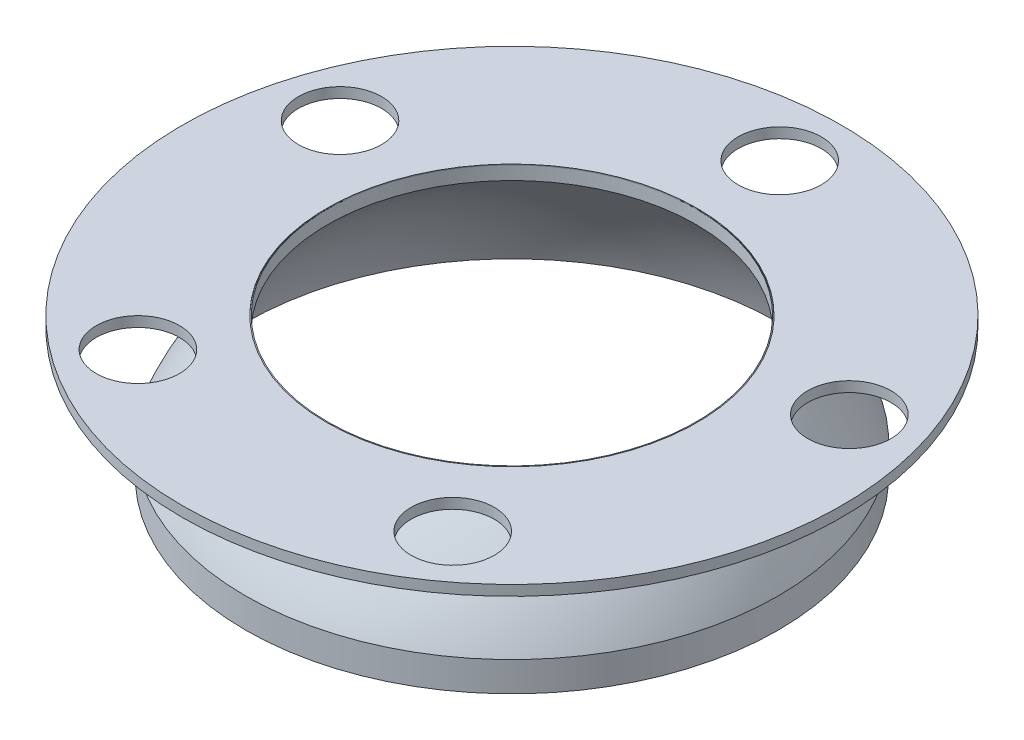
ISO-10303-21;
HEADER;
FILE_DESCRIPTION(('STEP AP214'),'2;1');
FILE_NAME('part.step','',(''),(''),'','','');
FILE_SCHEMA(('AUTOMOTIVE_DESIGN { 1 0 10303 214 1 1 1 1 }'));
ENDSEC;
DATA;
#1=APPLICATION_CONTEXT('core data for automotive mechanical design processes');
#2=APPLICATION_PROTOCOL_DEFINITION('international standard','automotive_design',2000,#1);
#3=PRODUCT_CONTEXT('',#1,'mechanical');
#4=PRODUCT('Part','Part','',(#3));
#5=PRODUCT_RELATED_PRODUCT_CATEGORY('part','',(#4));
#6=PRODUCT_DEFINITION_FORMATION('','',#4);
#7=PRODUCT_DEFINITION_CONTEXT('part definition',#1,'design');
#8=PRODUCT_DEFINITION('design','',#6,#7);
#9=PRODUCT_DEFINITION_SHAPE('','',#8);
#10=(LENGTH_UNIT() NAMED_UNIT(*) SI_UNIT(.MILLI.,.METRE.));
#11=(NAMED_UNIT(*) PLANE_ANGLE_UNIT() SI_UNIT($,.RADIAN.));
#12=(NAMED_UNIT(*) SI_UNIT($,.STERADIAN.) SOLID_ANGLE_UNIT());
#13=UNCERTAINTY_MEASURE_WITH_UNIT(LENGTH_MEASURE(1.E-05),#10,'distance_accuracy_value','');
#14=(GEOMETRIC_REPRESENTATION_CONTEXT(3) GLOBAL_UNCERTAINTY_ASSIGNED_CONTEXT((#13)) GLOBAL_UNIT_ASSIGNED_CONTEXT((#10,
#11,#12)) REPRESENTATION_CONTEXT('',''));
#15=CARTESIAN_POINT('',(0.,0.,0.));
#16=DIRECTION('',(0.,0.,1.));
#17=DIRECTION('',(1.,0.,0.));
#18=AXIS2_PLACEMENT_3D('',#15,#16,#17);
#19=CARTESIAN_POINT('',(0.,3.175,-82.55));
#20=DIRECTION('',(0.,-1.,0.));
#21=DIRECTION('',(0.,0.,-1.));
#22=AXIS2_PLACEMENT_3D('',#19,#20,#21);
#23=CYLINDRICAL_SURFACE('',#22,12.827);
#24=CARTESIAN_POINT('',(0.,3.175,-82.55));
#25=DIRECTION('',(0.,1.,0.));
#26=DIRECTION('',(0.,0.,1.));
#27=AXIS2_PLACEMENT_3D('',#24,#25,#26);
#28=CIRCLE('',#27,12.827);
#29=CARTESIAN_POINT('',(0.,3.175,-69.723));
#30=VERTEX_POINT('',#29);
#31=EDGE_CURVE('E49',#30,#30,#28,.T.);
#32=ORIENTED_EDGE('',*,*,#31,.T.);
#33=EDGE_LOOP('',(#32));
#34=FACE_BOUND('',#33,.T.);
#35=CARTESIAN_POINT('',(0.,0.,-82.55));
#36=DIRECTION('',(0.,1.,0.));
#37=DIRECTION('',(0.,0.,1.));
#38=AXIS2_PLACEMENT_3D('',#35,#36,#37);
#39=CIRCLE('',#38,12.827);
#40=CARTESIAN_POINT('',(0.,0.,-69.723));
#41=VERTEX_POINT('',#40);
#42=EDGE_CURVE('E72',#41,#41,#39,.T.);
#43=ORIENTED_EDGE('',*,*,#42,.F.);
#44=EDGE_LOOP('',(#43));
#45=FACE_BOUND('',#44,.T.);
#46=ADVANCED_FACE('F41',(#34,#45),#23,.F.);
#47=CARTESIAN_POINT('',(78.5097154201674,3.175,-25.5093528856553));
#48=DIRECTION('',(0.,-1.,0.));
#49=DIRECTION('',(0.,0.,-1.));
#50=AXIS2_PLACEMENT_3D('',#47,#48,#49);
#51=CYLINDRICAL_SURFACE('',#50,12.827);
#52=CARTESIAN_POINT('',(78.5097154201674,3.175,-25.5093528856553));
#53=DIRECTION('',(0.,1.,0.));
#54=DIRECTION('',(0.,0.,1.));
#55=AXIS2_PLACEMENT_3D('',#52,#53,#54);
#56=CIRCLE('',#55,12.827);
#57=CARTESIAN_POINT('',(78.5097154201674,3.175,-12.6823528856553));
#58=VERTEX_POINT('',#57);
#59=EDGE_CURVE('E54',#58,#58,#56,.T.);
#60=ORIENTED_EDGE('',*,*,#59,.T.);
#61=EDGE_LOOP('',(#60));
#62=FACE_BOUND('',#61,.T.);
#63=CARTESIAN_POINT('',(78.5097154201674,0.,-25.5093528856553));
#64=DIRECTION('',(0.,1.,0.));
#65=DIRECTION('',(0.,0.,1.));
#66=AXIS2_PLACEMENT_3D('',#63,#64,#65);
#67=CIRCLE('',#66,12.827);
#68=CARTESIAN_POINT('',(78.5097154201674,0.,-12.6823528856553));
#69=VERTEX_POINT('',#68);
#70=EDGE_CURVE('E70',#69,#69,#67,.T.);
#71=ORIENTED_EDGE('',*,*,#70,.F.);
#72=EDGE_LOOP('',(#71));
#73=FACE_BOUND('',#72,.T.);
#74=ADVANCED_FACE('F96',(#62,#73),#51,.F.);
#75=CARTESIAN_POINT('',(48.52167257675,3.175,66.7843528856499));
#76=DIRECTION('',(0.,-1.,0.));
#77=DIRECTION('',(0.,0.,-1.));
#78=AXIS2_PLACEMENT_3D('',#75,#76,#77);
#79=CYLINDRICAL_SURFACE('',#78,12.827);
#80=CARTESIAN_POINT('',(48.52167257675,3.175,66.7843528856499));
#81=DIRECTION('',(0.,1.,0.));
#82=DIRECTION('',(0.,0.,1.));
#83=AXIS2_PLACEMENT_3D('',#80,#81,#82);
#84=CIRCLE('',#83,12.827);
#85=CARTESIAN_POINT('',(48.52167257675,3.175,79.6113528856499));
#86=VERTEX_POINT('',#85);
#87=EDGE_CURVE('E91',#86,#86,#84,.T.);
#88=ORIENTED_EDGE('',*,*,#87,.T.);
#89=EDGE_LOOP('',(#88));
#90=FACE_BOUND('',#89,.T.);
#91=CARTESIAN_POINT('',(48.52167257675,0.,66.7843528856499));
#92=DIRECTION('',(0.,1.,0.));
#93=DIRECTION('',(0.,0.,1.));
#94=AXIS2_PLACEMENT_3D('',#91,#92,#93);
#95=CIRCLE('',#94,12.827);
#96=CARTESIAN_POINT('',(48.52167257675,0.,79.6113528856499));
#97=VERTEX_POINT('',#96);
#98=EDGE_CURVE('E67',#97,#97,#95,.T.);
#99=ORIENTED_EDGE('',*,*,#98,.F.);
#100=EDGE_LOOP('',(#99));
#101=FACE_BOUND('',#100,.T.);
#102=ADVANCED_FACE('F114',(#90,#101),#79,.F.);
#103=CARTESIAN_POINT('',(-48.5216725767373,3.175,66.784352885654));
#104=DIRECTION('',(0.,-1.,0.));
#105=DIRECTION('',(0.,0.,-1.));
#106=AXIS2_PLACEMENT_3D('',#103,#104,#105);
#107=CYLINDRICAL_SURFACE('',#106,12.827);
#108=CARTESIAN_POINT('',(-48.5216725767373,3.175,66.784352885654));
#109=DIRECTION('',(0.,1.,0.));
#110=DIRECTION('',(0.,0.,1.));
#111=AXIS2_PLACEMENT_3D('',#108,#109,#110);
#112=CIRCLE('',#111,12.827);
#113=CARTESIAN_POINT('',(-48.5216725767373,3.175,79.611352885654));
#114=VERTEX_POINT('',#113);
#115=EDGE_CURVE('E86',#114,#114,#112,.T.);
#116=ORIENTED_EDGE('',*,*,#115,.T.);
#117=EDGE_LOOP('',(#116));
#118=FACE_BOUND('',#117,.T.);
#119=CARTESIAN_POINT('',(-48.5216725767373,0.,66.784352885654));
#120=DIRECTION('',(0.,1.,0.));
#121=DIRECTION('',(0.,0.,1.));
#122=AXIS2_PLACEMENT_3D('',#119,#120,#121);
#123=CIRCLE('',#122,12.827);
#124=CARTESIAN_POINT('',(-48.5216725767373,0.,79.611352885654));
#125=VERTEX_POINT('',#124);
#126=EDGE_CURVE('E64',#125,#125,#123,.T.);
#127=ORIENTED_EDGE('',*,*,#126,.F.);
#128=EDGE_LOOP('',(#127));
#129=FACE_BOUND('',#128,.T.);
#130=ADVANCED_FACE('F121',(#118,#129),#107,.F.);
#131=CARTESIAN_POINT('',(-78.5097154201625,3.175,-25.5093528856486));
#132=DIRECTION('',(0.,-1.,0.));
#133=DIRECTION('',(0.,0.,-1.));
#134=AXIS2_PLACEMENT_3D('',#131,#132,#133);
#135=CYLINDRICAL_SURFACE('',#134,12.827);
#136=CARTESIAN_POINT('',(-78.5097154201625,3.175,-25.5093528856486));
#137=DIRECTION('',(0.,1.,0.));
#138=DIRECTION('',(0.,0.,1.));
#139=AXIS2_PLACEMENT_3D('',#136,#137,#138);
#140=CIRCLE('',#139,12.827);
#141=CARTESIAN_POINT('',(-78.5097154201625,3.175,-12.6823528856486));
#142=VERTEX_POINT('',#141);
#143=EDGE_CURVE('E81',#142,#142,#140,.T.);
#144=ORIENTED_EDGE('',*,*,#143,.T.);
#145=EDGE_LOOP('',(#144));
#146=FACE_BOUND('',#145,.T.);
#147=CARTESIAN_POINT('',(-78.5097154201625,0.,-25.5093528856486));
#148=DIRECTION('',(0.,1.,0.));
#149=DIRECTION('',(0.,0.,1.));
#150=AXIS2_PLACEMENT_3D('',#147,#148,#149);
#151=CIRCLE('',#150,12.827);
#152=CARTESIAN_POINT('',(-78.5097154201625,0.,-12.6823528856486));
#153=VERTEX_POINT('',#152);
#154=EDGE_CURVE('E61',#153,#153,#151,.T.);
#155=ORIENTED_EDGE('',*,*,#154,.F.);
#156=EDGE_LOOP('',(#155));
#157=FACE_BOUND('',#156,.T.);
#158=ADVANCED_FACE('F124',(#146,#157),#135,.F.);
#159=CARTESIAN_POINT('',(0.,3.175,0.));
#160=DIRECTION('',(0.,-1.,0.));
#161=DIRECTION('',(0.,0.,-1.));
#162=AXIS2_PLACEMENT_3D('',#159,#160,#161);
#163=CYLINDRICAL_SURFACE('',#162,57.15);
#164=CARTESIAN_POINT('',(0.,3.175,0.));
#165=DIRECTION('',(0.,1.,0.));
#166=DIRECTION('',(0.,0.,1.));
#167=AXIS2_PLACEMENT_3D('',#164,#165,#166);
#168=CIRCLE('',#167,57.15);
#169=CARTESIAN_POINT('',(0.,3.175,57.15));
#170=VERTEX_POINT('',#169);
#171=EDGE_CURVE('E77',#170,#170,#168,.T.);
#172=ORIENTED_EDGE('',*,*,#171,.T.);
#173=EDGE_LOOP('',(#172));
#174=FACE_BOUND('',#173,.T.);
#175=CARTESIAN_POINT('',(0.,0.,0.));
#176=DIRECTION('',(0.,1.,0.));
#177=DIRECTION('',(0.,0.,1.));
#178=AXIS2_PLACEMENT_3D('',#175,#176,#177);
#179=CIRCLE('',#178,57.15);
#180=CARTESIAN_POINT('',(0.,0.,57.15));
#181=VERTEX_POINT('',#180);
#182=EDGE_CURVE('E58',#181,#181,#179,.T.);
#183=ORIENTED_EDGE('',*,*,#182,.F.);
#184=EDGE_LOOP('',(#183));
#185=FACE_BOUND('',#184,.T.);
#186=ADVANCED_FACE('F43',(#174,#185),#163,.F.);
#187=CARTESIAN_POINT('',(0.,3.175,0.));
#188=DIRECTION('',(0.,-1.,0.));
#189=DIRECTION('',(0.,0.,-1.));
#190=AXIS2_PLACEMENT_3D('',#187,#188,#189);
#191=CYLINDRICAL_SURFACE('',#190,101.6);
#192=CARTESIAN_POINT('',(0.,3.175,0.));
#193=DIRECTION('',(0.,1.,0.));
#194=DIRECTION('',(0.,0.,1.));
#195=AXIS2_PLACEMENT_3D('',#192,#193,#194);
#196=CIRCLE('',#195,101.6);
#197=CARTESIAN_POINT('',(0.,3.175,101.6));
#198=VERTEX_POINT('',#197);
#199=EDGE_CURVE('E11',#198,#198,#196,.T.);
#200=ORIENTED_EDGE('',*,*,#199,.F.);
#201=EDGE_LOOP('',(#200));
#202=FACE_BOUND('',#201,.T.);
#203=CARTESIAN_POINT('',(0.,0.,0.));
#204=DIRECTION('',(0.,1.,0.));
#205=DIRECTION('',(0.,0.,1.));
#206=AXIS2_PLACEMENT_3D('',#203,#204,#205);
#207=CIRCLE('',#206,101.6);
#208=CARTESIAN_POINT('',(0.,0.,101.6));
#209=VERTEX_POINT('',#208);
#210=EDGE_CURVE('E45',#209,#209,#207,.T.);
#211=ORIENTED_EDGE('',*,*,#210,.T.);
#212=EDGE_LOOP('',(#211));
#213=FACE_BOUND('',#212,.T.);
#214=ADVANCED_FACE('F103',(#202,#213),#191,.T.);
#215=CARTESIAN_POINT('',(0.,3.175,0.));
#216=DIRECTION('',(0.,1.,0.));
#217=DIRECTION('',(0.,0.,1.));
#218=AXIS2_PLACEMENT_3D('',#215,#216,#217);
#219=PLANE('',#218);
#220=ORIENTED_EDGE('',*,*,#171,.F.);
#221=EDGE_LOOP('',(#220));
#222=FACE_BOUND('',#221,.T.);
#223=ORIENTED_EDGE('',*,*,#143,.F.);
#224=EDGE_LOOP('',(#223));
#225=FACE_BOUND('',#224,.T.);
#226=ORIENTED_EDGE('',*,*,#115,.F.);
#227=EDGE_LOOP('',(#226));
#228=FACE_BOUND('',#227,.T.);
#229=ORIENTED_EDGE('',*,*,#87,.F.);
#230=EDGE_LOOP('',(#229));
#231=FACE_BOUND('',#230,.T.);
#232=ORIENTED_EDGE('',*,*,#59,.F.);
#233=EDGE_LOOP('',(#232));
#234=FACE_BOUND('',#233,.T.);
#235=ORIENTED_EDGE('',*,*,#31,.F.);
#236=EDGE_LOOP('',(#235));
#237=FACE_BOUND('',#236,.T.);
#238=ORIENTED_EDGE('',*,*,#199,.T.);
#239=EDGE_LOOP('',(#238));
#240=FACE_BOUND('',#239,.T.);
#241=ADVANCED_FACE('F99',(#222,#225,#228,#231,#234,#237,#240),#219,.T.);
#242=CARTESIAN_POINT('',(0.,0.,0.));
#243=DIRECTION('',(0.,1.,0.));
#244=DIRECTION('',(0.,0.,1.));
#245=AXIS2_PLACEMENT_3D('',#242,#243,#244);
#246=PLANE('',#245);
#247=ORIENTED_EDGE('',*,*,#182,.T.);
#248=EDGE_LOOP('',(#247));
#249=FACE_BOUND('',#248,.T.);
#250=ORIENTED_EDGE('',*,*,#154,.T.);
#251=EDGE_LOOP('',(#250));
#252=FACE_BOUND('',#251,.T.);
#253=ORIENTED_EDGE('',*,*,#126,.T.);
#254=EDGE_LOOP('',(#253));
#255=FACE_BOUND('',#254,.T.);
#256=ORIENTED_EDGE('',*,*,#98,.T.);
#257=EDGE_LOOP('',(#256));
#258=FACE_BOUND('',#257,.T.);
#259=ORIENTED_EDGE('',*,*,#70,.T.);
#260=EDGE_LOOP('',(#259));
#261=FACE_BOUND('',#260,.T.);
#262=ORIENTED_EDGE('',*,*,#42,.T.);
#263=EDGE_LOOP('',(#262));
#264=FACE_BOUND('',#263,.T.);
#265=ORIENTED_EDGE('',*,*,#210,.F.);
#266=EDGE_LOOP('',(#265));
#267=FACE_BOUND('',#266,.T.);
#268=ADVANCED_FACE('F102',(#249,#252,#255,#258,#261,#264,#267),#246,.F.);
#269=CLOSED_SHELL('',(#46,#74,#102,#130,#158,#186,#214,#241,#268));
#270=MANIFOLD_SOLID_BREP('B2',#269);
#271=CARTESIAN_POINT('',(0.,-65.6894476841978,0.));
#272=DIRECTION('',(0.,-1.,0.));
#273=DIRECTION('',(0.,0.,1.));
#274=AXIS2_PLACEMENT_3D('',#271,#272,#273);
#275=SPHERICAL_SURFACE('',#274,89.285);
#276=CARTESIAN_POINT('',(0.,-30.6581575299108,0.));
#277=DIRECTION('',(0.,-1.,0.));
#278=DIRECTION('',(0.,0.,-1.));
#279=AXIS2_PLACEMENT_3D('',#276,#277,#278);
#280=CIRCLE('',#279,82.1256350668057);
#281=CARTESIAN_POINT('',(0.,-30.6581575299108,-82.1256350668057));
#282=VERTEX_POINT('',#281);
#283=EDGE_CURVE('E40',#282,#282,#280,.T.);
#284=ORIENTED_EDGE('',*,*,#283,.F.);
#285=EDGE_LOOP('',(#284));
#286=FACE_BOUND('',#285,.T.);
#287=CARTESIAN_POINT('',(0.,3.16973298959207,0.));
#288=DIRECTION('',(0.,-1.,0.));
#289=DIRECTION('',(0.,0.,-1.));
#290=AXIS2_PLACEMENT_3D('',#287,#288,#289);
#291=CIRCLE('',#290,56.8350636661415);
#292=CARTESIAN_POINT('',(0.,3.16973298959207,-56.8350636661415));
#293=VERTEX_POINT('',#292);
#294=EDGE_CURVE('E222',#293,#293,#291,.T.);
#295=ORIENTED_EDGE('',*,*,#294,.T.);
#296=EDGE_LOOP('',(#295));
#297=FACE_BOUND('',#296,.T.);
#298=ADVANCED_FACE('F208',(#286,#297),#275,.T.);
#299=CARTESIAN_POINT('',(0.,-65.6894476841978,0.));
#300=DIRECTION('',(0.,-1.,0.));
#301=DIRECTION('',(0.,0.,-1.));
#302=AXIS2_PLACEMENT_3D('',#299,#300,#301);
#303=CYLINDRICAL_SURFACE('',#302,82.1256350668057);
#304=CARTESIAN_POINT('',(0.,-39.7990601847059,0.));
#305=DIRECTION('',(0.,-1.,0.));
#306=DIRECTION('',(0.,0.,-1.));
#307=AXIS2_PLACEMENT_3D('',#304,#305,#306);
#308=CIRCLE('',#307,82.1256350668057);
#309=CARTESIAN_POINT('',(0.,-39.7990601847059,-82.1256350668057));
#310=VERTEX_POINT('',#309);
#311=EDGE_CURVE('E214',#310,#310,#308,.T.);
#312=ORIENTED_EDGE('',*,*,#311,.F.);
#313=EDGE_LOOP('',(#312));
#314=FACE_BOUND('',#313,.T.);
#315=ORIENTED_EDGE('',*,*,#283,.T.);
#316=EDGE_LOOP('',(#315));
#317=FACE_BOUND('',#316,.T.);
#318=ADVANCED_FACE('F237',(#314,#317),#303,.T.);
#319=CARTESIAN_POINT('',(0.,-65.6894476841978,0.));
#320=DIRECTION('',(0.,-1.,0.));
#321=DIRECTION('',(0.,0.,1.));
#322=AXIS2_PLACEMENT_3D('',#319,#320,#321);
#323=SPHERICAL_SURFACE('',#322,86.11);
#324=CARTESIAN_POINT('',(0.,-1.00013142513043,0.));
#325=DIRECTION('',(0.,-1.,0.));
#326=DIRECTION('',(0.,0.,-1.));
#327=AXIS2_PLACEMENT_3D('',#324,#325,#326);
#328=CIRCLE('',#327,56.8350636661415);
#329=CARTESIAN_POINT('',(0.,-1.00013142513043,-56.8350636661415));
#330=VERTEX_POINT('',#329);
#331=EDGE_CURVE('E218',#330,#330,#328,.T.);
#332=ORIENTED_EDGE('',*,*,#331,.F.);
#333=EDGE_LOOP('',(#332));
#334=FACE_BOUND('',#333,.T.);
#335=ORIENTED_EDGE('',*,*,#311,.T.);
#336=EDGE_LOOP('',(#335));
#337=FACE_BOUND('',#336,.T.);
#338=ADVANCED_FACE('F232',(#334,#337),#323,.F.);
#339=CARTESIAN_POINT('',(0.,-65.6894476841978,0.));
#340=DIRECTION('',(0.,-1.,0.));
#341=DIRECTION('',(0.,0.,-1.));
#342=AXIS2_PLACEMENT_3D('',#339,#340,#341);
#343=CYLINDRICAL_SURFACE('',#342,56.8350636661415);
#344=ORIENTED_EDGE('',*,*,#294,.F.);
#345=EDGE_LOOP('',(#344));
#346=FACE_BOUND('',#345,.T.);
#347=ORIENTED_EDGE('',*,*,#331,.T.);
#348=EDGE_LOOP('',(#347));
#349=FACE_BOUND('',#348,.T.);
#350=ADVANCED_FACE('F229',(#346,#349),#343,.F.);
#351=CLOSED_SHELL('',(#298,#318,#338,#350));
#352=MANIFOLD_SOLID_BREP('B6',#351);
#353=ADVANCED_BREP_SHAPE_REPRESENTATION('',(#18,#270,#352),#14);
#354=SHAPE_DEFINITION_REPRESENTATION(#9,#353);
ENDSEC;
END-ISO-10303-21;
